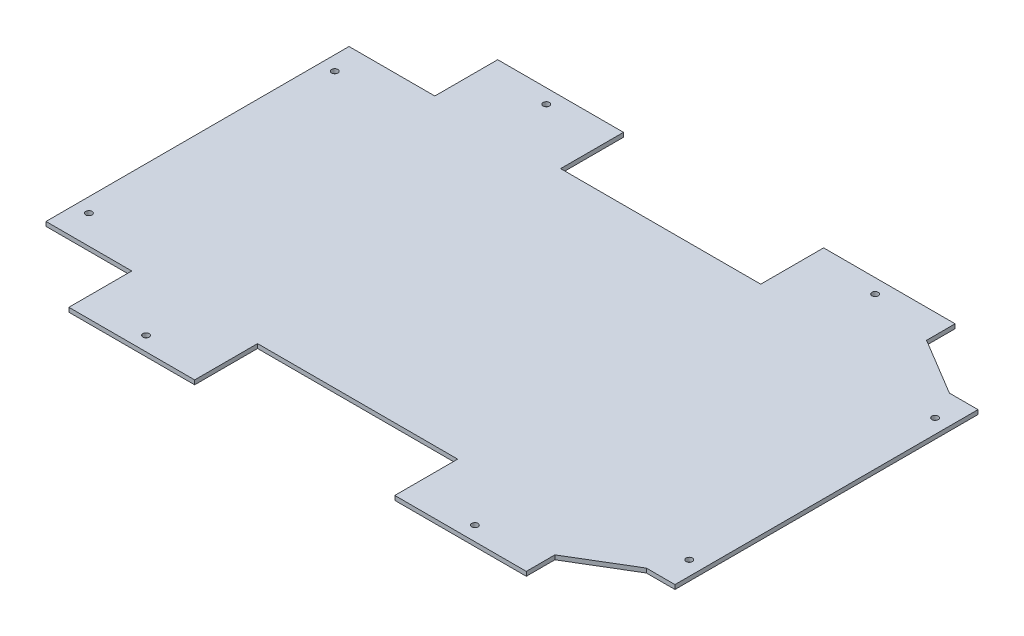
ISO-10303-21;
HEADER;
FILE_DESCRIPTION(('STEP AP214'),'2;1');
FILE_NAME('part.step','',(''),(''),'','','');
FILE_SCHEMA(('AUTOMOTIVE_DESIGN { 1 0 10303 214 1 1 1 1 }'));
ENDSEC;
DATA;
#1=APPLICATION_CONTEXT('core data for automotive mechanical design processes');
#2=APPLICATION_PROTOCOL_DEFINITION('international standard','automotive_design',2000,#1);
#3=PRODUCT_CONTEXT('',#1,'mechanical');
#4=PRODUCT('Part','Part','',(#3));
#5=PRODUCT_RELATED_PRODUCT_CATEGORY('part','',(#4));
#6=PRODUCT_DEFINITION_FORMATION('','',#4);
#7=PRODUCT_DEFINITION_CONTEXT('part definition',#1,'design');
#8=PRODUCT_DEFINITION('design','',#6,#7);
#9=PRODUCT_DEFINITION_SHAPE('','',#8);
#10=(LENGTH_UNIT() NAMED_UNIT(*) SI_UNIT(.MILLI.,.METRE.));
#11=(NAMED_UNIT(*) PLANE_ANGLE_UNIT() SI_UNIT($,.RADIAN.));
#12=(NAMED_UNIT(*) SI_UNIT($,.STERADIAN.) SOLID_ANGLE_UNIT());
#13=UNCERTAINTY_MEASURE_WITH_UNIT(LENGTH_MEASURE(1.E-05),#10,'distance_accuracy_value','');
#14=(GEOMETRIC_REPRESENTATION_CONTEXT(3) GLOBAL_UNCERTAINTY_ASSIGNED_CONTEXT((#13)) GLOBAL_UNIT_ASSIGNED_CONTEXT((#10,
#11,#12)) REPRESENTATION_CONTEXT('',''));
#15=CARTESIAN_POINT('',(0.,0.,0.));
#16=DIRECTION('',(0.,0.,1.));
#17=DIRECTION('',(1.,0.,0.));
#18=AXIS2_PLACEMENT_3D('',#15,#16,#17);
#19=CARTESIAN_POINT('',(217.809683940575,3.,-105.73789445247));
#20=DIRECTION('',(0.,0.,1.));
#21=DIRECTION('',(1.,0.,0.));
#22=AXIS2_PLACEMENT_3D('',#19,#20,#21);
#23=PLANE('',#22);
#24=DIRECTION('',(-1.,0.,0.));
#25=VECTOR('',#24,1.);
#26=CARTESIAN_POINT('',(217.809683940575,0.,-105.73789445247));
#27=LINE('',#26,#25);
#28=CARTESIAN_POINT('',(217.809683940575,0.,-105.73789445247));
#29=VERTEX_POINT('',#28);
#30=CARTESIAN_POINT('',(197.809683940615,0.,-105.73789445247));
#31=VERTEX_POINT('',#30);
#32=EDGE_CURVE('E214',#29,#31,#27,.T.);
#33=ORIENTED_EDGE('',*,*,#32,.T.);
#34=DIRECTION('',(0.,-1.,0.));
#35=VECTOR('',#34,1.);
#36=CARTESIAN_POINT('',(197.809683940615,3.,-105.73789445247));
#37=LINE('',#36,#35);
#38=CARTESIAN_POINT('',(197.809683940615,3.,-105.73789445247));
#39=VERTEX_POINT('',#38);
#40=EDGE_CURVE('E11',#39,#31,#37,.T.);
#41=ORIENTED_EDGE('',*,*,#40,.F.);
#42=DIRECTION('',(-1.,0.,0.));
#43=VECTOR('',#42,1.);
#44=CARTESIAN_POINT('',(217.809683940575,3.,-105.73789445247));
#45=LINE('',#44,#43);
#46=CARTESIAN_POINT('',(217.809683940575,3.,-105.73789445247));
#47=VERTEX_POINT('',#46);
#48=EDGE_CURVE('E257',#47,#39,#45,.T.);
#49=ORIENTED_EDGE('',*,*,#48,.F.);
#50=DIRECTION('',(0.,-1.,0.));
#51=VECTOR('',#50,1.);
#52=CARTESIAN_POINT('',(217.809683940575,3.,-105.73789445247));
#53=LINE('',#52,#51);
#54=EDGE_CURVE('E210',#47,#29,#53,.T.);
#55=ORIENTED_EDGE('',*,*,#54,.T.);
#56=EDGE_LOOP('',(#33,#41,#49,#55));
#57=FACE_BOUND('',#56,.T.);
#58=ADVANCED_FACE('F34',(#57),#23,.F.);
#59=CARTESIAN_POINT('',(197.809683940615,3.,-105.73789445247));
#60=DIRECTION('',(-0.514495755423212,0.,0.857492925715133));
#61=DIRECTION('',(0.857492925715133,0.,0.514495755423212));
#62=AXIS2_PLACEMENT_3D('',#59,#60,#61);
#63=PLANE('',#62);
#64=DIRECTION('',(-0.857492925715133,0.,-0.514495755423212));
#65=VECTOR('',#64,1.);
#66=CARTESIAN_POINT('',(197.809683940615,0.,-105.73789445247));
#67=LINE('',#66,#65);
#68=CARTESIAN_POINT('',(157.809683940159,0.,-129.73789445247));
#69=VERTEX_POINT('',#68);
#70=EDGE_CURVE('E217',#31,#69,#67,.T.);
#71=ORIENTED_EDGE('',*,*,#70,.T.);
#72=DIRECTION('',(0.,-1.,0.));
#73=VECTOR('',#72,1.);
#74=CARTESIAN_POINT('',(157.809683940159,3.,-129.73789445247));
#75=LINE('',#74,#73);
#76=CARTESIAN_POINT('',(157.809683940159,3.,-129.73789445247));
#77=VERTEX_POINT('',#76);
#78=EDGE_CURVE('E42',#77,#69,#75,.T.);
#79=ORIENTED_EDGE('',*,*,#78,.F.);
#80=DIRECTION('',(-0.857492925715133,0.,-0.514495755423212));
#81=VECTOR('',#80,1.);
#82=CARTESIAN_POINT('',(197.809683940615,3.,-105.73789445247));
#83=LINE('',#82,#81);
#84=EDGE_CURVE('E135',#39,#77,#83,.T.);
#85=ORIENTED_EDGE('',*,*,#84,.F.);
#86=ORIENTED_EDGE('',*,*,#40,.T.);
#87=EDGE_LOOP('',(#71,#79,#85,#86));
#88=FACE_BOUND('',#87,.T.);
#89=ADVANCED_FACE('F386',(#88),#63,.F.);
#90=CARTESIAN_POINT('',(157.809683940159,3.,-129.73789445247));
#91=DIRECTION('',(-1.,0.,0.));
#92=DIRECTION('',(0.,0.,1.));
#93=AXIS2_PLACEMENT_3D('',#90,#91,#92);
#94=PLANE('',#93);
#95=DIRECTION('',(0.,0.,-1.));
#96=VECTOR('',#95,1.);
#97=CARTESIAN_POINT('',(157.809683940159,0.,-129.73789445247));
#98=LINE('',#97,#96);
#99=CARTESIAN_POINT('',(157.809683940159,0.,-149.737894452469));
#100=VERTEX_POINT('',#99);
#101=EDGE_CURVE('E220',#69,#100,#98,.T.);
#102=ORIENTED_EDGE('',*,*,#101,.T.);
#103=DIRECTION('',(0.,-1.,0.));
#104=VECTOR('',#103,1.);
#105=CARTESIAN_POINT('',(157.809683940159,3.,-149.737894452469));
#106=LINE('',#105,#104);
#107=CARTESIAN_POINT('',(157.809683940159,3.,-149.737894452469));
#108=VERTEX_POINT('',#107);
#109=EDGE_CURVE('E306',#108,#100,#106,.T.);
#110=ORIENTED_EDGE('',*,*,#109,.F.);
#111=DIRECTION('',(0.,0.,-1.));
#112=VECTOR('',#111,1.);
#113=CARTESIAN_POINT('',(157.809683940159,3.,-129.73789445247));
#114=LINE('',#113,#112);
#115=EDGE_CURVE('E314',#77,#108,#114,.T.);
#116=ORIENTED_EDGE('',*,*,#115,.F.);
#117=ORIENTED_EDGE('',*,*,#78,.T.);
#118=EDGE_LOOP('',(#102,#110,#116,#117));
#119=FACE_BOUND('',#118,.T.);
#120=ADVANCED_FACE('F312',(#119),#94,.F.);
#121=CARTESIAN_POINT('',(157.809683940159,3.,-149.737894452469));
#122=DIRECTION('',(0.,0.,1.));
#123=DIRECTION('',(1.,0.,0.));
#124=AXIS2_PLACEMENT_3D('',#121,#122,#123);
#125=PLANE('',#124);
#126=DIRECTION('',(-1.,0.,0.));
#127=VECTOR('',#126,1.);
#128=CARTESIAN_POINT('',(157.809683940159,0.,-149.737894452469));
#129=LINE('',#128,#127);
#130=CARTESIAN_POINT('',(65.8096845297192,0.,-149.737894452469));
#131=VERTEX_POINT('',#130);
#132=EDGE_CURVE('E222',#100,#131,#129,.T.);
#133=ORIENTED_EDGE('',*,*,#132,.T.);
#134=DIRECTION('',(0.,-1.,0.));
#135=VECTOR('',#134,1.);
#136=CARTESIAN_POINT('',(65.8096845297192,3.,-149.737894452469));
#137=LINE('',#136,#135);
#138=CARTESIAN_POINT('',(65.8096845297192,3.,-149.737894452469));
#139=VERTEX_POINT('',#138);
#140=EDGE_CURVE('E303',#139,#131,#137,.T.);
#141=ORIENTED_EDGE('',*,*,#140,.F.);
#142=DIRECTION('',(-1.,0.,0.));
#143=VECTOR('',#142,1.);
#144=CARTESIAN_POINT('',(157.809683940159,3.,-149.737894452469));
#145=LINE('',#144,#143);
#146=EDGE_CURVE('E332',#108,#139,#145,.T.);
#147=ORIENTED_EDGE('',*,*,#146,.F.);
#148=ORIENTED_EDGE('',*,*,#109,.T.);
#149=EDGE_LOOP('',(#133,#141,#147,#148));
#150=FACE_BOUND('',#149,.T.);
#151=ADVANCED_FACE('F323',(#150),#125,.F.);
#152=CARTESIAN_POINT('',(65.8096845297192,3.,-105.737894452469));
#153=DIRECTION('',(1.,0.,0.));
#154=DIRECTION('',(0.,0.,-1.));
#155=AXIS2_PLACEMENT_3D('',#152,#153,#154);
#156=PLANE('',#155);
#157=DIRECTION('',(0.,0.,1.));
#158=VECTOR('',#157,1.);
#159=CARTESIAN_POINT('',(65.8096845297192,0.,-105.737894452469));
#160=LINE('',#159,#158);
#161=CARTESIAN_POINT('',(65.8096845297192,0.,-105.737894452469));
#162=VERTEX_POINT('',#161);
#163=EDGE_CURVE('E224',#131,#162,#160,.T.);
#164=ORIENTED_EDGE('',*,*,#163,.T.);
#165=DIRECTION('',(0.,-1.,0.));
#166=VECTOR('',#165,1.);
#167=CARTESIAN_POINT('',(65.8096845297192,3.,-105.737894452469));
#168=LINE('',#167,#166);
#169=CARTESIAN_POINT('',(65.8096845297192,3.,-105.737894452469));
#170=VERTEX_POINT('',#169);
#171=EDGE_CURVE('E300',#170,#162,#168,.T.);
#172=ORIENTED_EDGE('',*,*,#171,.F.);
#173=DIRECTION('',(0.,0.,1.));
#174=VECTOR('',#173,1.);
#175=CARTESIAN_POINT('',(65.8096845297192,3.,-105.737894452469));
#176=LINE('',#175,#174);
#177=EDGE_CURVE('E329',#139,#170,#176,.T.);
#178=ORIENTED_EDGE('',*,*,#177,.F.);
#179=ORIENTED_EDGE('',*,*,#140,.T.);
#180=EDGE_LOOP('',(#164,#172,#178,#179));
#181=FACE_BOUND('',#180,.T.);
#182=ADVANCED_FACE('F327',(#181),#156,.F.);
#183=CARTESIAN_POINT('',(65.8096845297192,3.,-105.737894452469));
#184=DIRECTION('',(0.,0.,1.));
#185=DIRECTION('',(1.,0.,0.));
#186=AXIS2_PLACEMENT_3D('',#183,#184,#185);
#187=PLANE('',#186);
#188=DIRECTION('',(-1.,0.,0.));
#189=VECTOR('',#188,1.);
#190=CARTESIAN_POINT('',(65.8096845297192,0.,-105.737894452469));
#191=LINE('',#190,#189);
#192=CARTESIAN_POINT('',(-74.1903154702808,0.,-105.737894452469));
#193=VERTEX_POINT('',#192);
#194=EDGE_CURVE('E226',#162,#193,#191,.T.);
#195=ORIENTED_EDGE('',*,*,#194,.T.);
#196=DIRECTION('',(0.,-1.,0.));
#197=VECTOR('',#196,1.);
#198=CARTESIAN_POINT('',(-74.1903154702808,3.,-105.737894452469));
#199=LINE('',#198,#197);
#200=CARTESIAN_POINT('',(-74.1903154702808,3.,-105.737894452469));
#201=VERTEX_POINT('',#200);
#202=EDGE_CURVE('E297',#201,#193,#199,.T.);
#203=ORIENTED_EDGE('',*,*,#202,.F.);
#204=DIRECTION('',(-1.,0.,0.));
#205=VECTOR('',#204,1.);
#206=CARTESIAN_POINT('',(65.8096845297192,3.,-105.737894452469));
#207=LINE('',#206,#205);
#208=EDGE_CURVE('E331',#170,#201,#207,.T.);
#209=ORIENTED_EDGE('',*,*,#208,.F.);
#210=ORIENTED_EDGE('',*,*,#171,.T.);
#211=EDGE_LOOP('',(#195,#203,#209,#210));
#212=FACE_BOUND('',#211,.T.);
#213=ADVANCED_FACE('F399',(#212),#187,.F.);
#214=CARTESIAN_POINT('',(-74.1903154702808,3.,-105.737894452469));
#215=DIRECTION('',(-1.,0.,0.));
#216=DIRECTION('',(0.,0.,1.));
#217=AXIS2_PLACEMENT_3D('',#214,#215,#216);
#218=PLANE('',#217);
#219=DIRECTION('',(0.,0.,-1.));
#220=VECTOR('',#219,1.);
#221=CARTESIAN_POINT('',(-74.1903154702808,0.,-105.737894452469));
#222=LINE('',#221,#220);
#223=CARTESIAN_POINT('',(-74.1903154702808,0.,-149.737894452469));
#224=VERTEX_POINT('',#223);
#225=EDGE_CURVE('E228',#193,#224,#222,.T.);
#226=ORIENTED_EDGE('',*,*,#225,.T.);
#227=DIRECTION('',(0.,-1.,0.));
#228=VECTOR('',#227,1.);
#229=CARTESIAN_POINT('',(-74.1903154702808,3.,-149.737894452469));
#230=LINE('',#229,#228);
#231=CARTESIAN_POINT('',(-74.1903154702808,3.,-149.737894452469));
#232=VERTEX_POINT('',#231);
#233=EDGE_CURVE('E294',#232,#224,#230,.T.);
#234=ORIENTED_EDGE('',*,*,#233,.F.);
#235=DIRECTION('',(0.,0.,-1.));
#236=VECTOR('',#235,1.);
#237=CARTESIAN_POINT('',(-74.1903154702808,3.,-105.737894452469));
#238=LINE('',#237,#236);
#239=EDGE_CURVE('E334',#201,#232,#238,.T.);
#240=ORIENTED_EDGE('',*,*,#239,.F.);
#241=ORIENTED_EDGE('',*,*,#202,.T.);
#242=EDGE_LOOP('',(#226,#234,#240,#241));
#243=FACE_BOUND('',#242,.T.);
#244=ADVANCED_FACE('F402',(#243),#218,.F.);
#245=CARTESIAN_POINT('',(-74.1903154702808,3.,-149.737894452469));
#246=DIRECTION('',(0.,0.,1.));
#247=DIRECTION('',(1.,0.,0.));
#248=AXIS2_PLACEMENT_3D('',#245,#246,#247);
#249=PLANE('',#248);
#250=DIRECTION('',(-1.,0.,0.));
#251=VECTOR('',#250,1.);
#252=CARTESIAN_POINT('',(-74.1903154702808,0.,-149.737894452469));
#253=LINE('',#252,#251);
#254=CARTESIAN_POINT('',(-162.190315499721,0.,-149.737894452469));
#255=VERTEX_POINT('',#254);
#256=EDGE_CURVE('E230',#224,#255,#253,.T.);
#257=ORIENTED_EDGE('',*,*,#256,.T.);
#258=DIRECTION('',(0.,-1.,0.));
#259=VECTOR('',#258,1.);
#260=CARTESIAN_POINT('',(-162.190315499721,3.,-149.737894452469));
#261=LINE('',#260,#259);
#262=CARTESIAN_POINT('',(-162.190315499721,3.,-149.737894452469));
#263=VERTEX_POINT('',#262);
#264=EDGE_CURVE('E291',#263,#255,#261,.T.);
#265=ORIENTED_EDGE('',*,*,#264,.F.);
#266=DIRECTION('',(-1.,0.,0.));
#267=VECTOR('',#266,1.);
#268=CARTESIAN_POINT('',(-74.1903154702808,3.,-149.737894452469));
#269=LINE('',#268,#267);
#270=EDGE_CURVE('E340',#232,#263,#269,.T.);
#271=ORIENTED_EDGE('',*,*,#270,.F.);
#272=ORIENTED_EDGE('',*,*,#233,.T.);
#273=EDGE_LOOP('',(#257,#265,#271,#272));
#274=FACE_BOUND('',#273,.T.);
#275=ADVANCED_FACE('F406',(#274),#249,.F.);
#276=CARTESIAN_POINT('',(-162.190315499721,3.,-105.737894452469));
#277=DIRECTION('',(1.,0.,0.));
#278=DIRECTION('',(0.,0.,-1.));
#279=AXIS2_PLACEMENT_3D('',#276,#277,#278);
#280=PLANE('',#279);
#281=DIRECTION('',(0.,0.,1.));
#282=VECTOR('',#281,1.);
#283=CARTESIAN_POINT('',(-162.190315499721,0.,-105.737894452469));
#284=LINE('',#283,#282);
#285=CARTESIAN_POINT('',(-162.190315499721,0.,-105.737894452469));
#286=VERTEX_POINT('',#285);
#287=EDGE_CURVE('E232',#255,#286,#284,.T.);
#288=ORIENTED_EDGE('',*,*,#287,.T.);
#289=DIRECTION('',(0.,-1.,0.));
#290=VECTOR('',#289,1.);
#291=CARTESIAN_POINT('',(-162.190315499721,3.,-105.737894452469));
#292=LINE('',#291,#290);
#293=CARTESIAN_POINT('',(-162.190315499721,3.,-105.737894452469));
#294=VERTEX_POINT('',#293);
#295=EDGE_CURVE('E288',#294,#286,#292,.T.);
#296=ORIENTED_EDGE('',*,*,#295,.F.);
#297=DIRECTION('',(0.,0.,1.));
#298=VECTOR('',#297,1.);
#299=CARTESIAN_POINT('',(-162.190315499721,3.,-105.737894452469));
#300=LINE('',#299,#298);
#301=EDGE_CURVE('E342',#263,#294,#300,.T.);
#302=ORIENTED_EDGE('',*,*,#301,.F.);
#303=ORIENTED_EDGE('',*,*,#264,.T.);
#304=EDGE_LOOP('',(#288,#296,#302,#303));
#305=FACE_BOUND('',#304,.T.);
#306=ADVANCED_FACE('F410',(#305),#280,.F.);
#307=CARTESIAN_POINT('',(-162.190315499721,3.,-105.737894452469));
#308=DIRECTION('',(0.,0.,1.));
#309=DIRECTION('',(1.,0.,0.));
#310=AXIS2_PLACEMENT_3D('',#307,#308,#309);
#311=PLANE('',#310);
#312=DIRECTION('',(-1.,0.,0.));
#313=VECTOR('',#312,1.);
#314=CARTESIAN_POINT('',(-162.190315499721,0.,-105.737894452469));
#315=LINE('',#314,#313);
#316=CARTESIAN_POINT('',(-222.190315500245,0.,-105.737894452469));
#317=VERTEX_POINT('',#316);
#318=EDGE_CURVE('E234',#286,#317,#315,.T.);
#319=ORIENTED_EDGE('',*,*,#318,.T.);
#320=DIRECTION('',(0.,-1.,0.));
#321=VECTOR('',#320,1.);
#322=CARTESIAN_POINT('',(-222.190315500245,3.,-105.737894452469));
#323=LINE('',#322,#321);
#324=CARTESIAN_POINT('',(-222.190315500245,3.,-105.737894452469));
#325=VERTEX_POINT('',#324);
#326=EDGE_CURVE('E285',#325,#317,#323,.T.);
#327=ORIENTED_EDGE('',*,*,#326,.F.);
#328=DIRECTION('',(-1.,0.,0.));
#329=VECTOR('',#328,1.);
#330=CARTESIAN_POINT('',(-162.190315499721,3.,-105.737894452469));
#331=LINE('',#330,#329);
#332=EDGE_CURVE('E344',#294,#325,#331,.T.);
#333=ORIENTED_EDGE('',*,*,#332,.F.);
#334=ORIENTED_EDGE('',*,*,#295,.T.);
#335=EDGE_LOOP('',(#319,#327,#333,#334));
#336=FACE_BOUND('',#335,.T.);
#337=ADVANCED_FACE('F414',(#336),#311,.F.);
#338=CARTESIAN_POINT('',(-222.190315500245,3.,-105.737894452469));
#339=DIRECTION('',(1.,0.,0.));
#340=DIRECTION('',(0.,0.,-1.));
#341=AXIS2_PLACEMENT_3D('',#338,#339,#340);
#342=PLANE('',#341);
#343=DIRECTION('',(0.,0.,1.));
#344=VECTOR('',#343,1.);
#345=CARTESIAN_POINT('',(-222.190315500245,0.,-105.737894452469));
#346=LINE('',#345,#344);
#347=CARTESIAN_POINT('',(-222.190315500245,0.,106.262104988581));
#348=VERTEX_POINT('',#347);
#349=EDGE_CURVE('E236',#317,#348,#346,.T.);
#350=ORIENTED_EDGE('',*,*,#349,.T.);
#351=DIRECTION('',(0.,-1.,0.));
#352=VECTOR('',#351,1.);
#353=CARTESIAN_POINT('',(-222.190315500245,3.,106.262104988581));
#354=LINE('',#353,#352);
#355=CARTESIAN_POINT('',(-222.190315500245,3.,106.262104988581));
#356=VERTEX_POINT('',#355);
#357=EDGE_CURVE('E282',#356,#348,#354,.T.);
#358=ORIENTED_EDGE('',*,*,#357,.F.);
#359=DIRECTION('',(0.,0.,1.));
#360=VECTOR('',#359,1.);
#361=CARTESIAN_POINT('',(-222.190315500245,3.,-105.737894452469));
#362=LINE('',#361,#360);
#363=EDGE_CURVE('E346',#325,#356,#362,.T.);
#364=ORIENTED_EDGE('',*,*,#363,.F.);
#365=ORIENTED_EDGE('',*,*,#326,.T.);
#366=EDGE_LOOP('',(#350,#358,#364,#365));
#367=FACE_BOUND('',#366,.T.);
#368=ADVANCED_FACE('F418',(#367),#342,.F.);
#369=CARTESIAN_POINT('',(-222.190315500245,3.,106.262104988581));
#370=DIRECTION('',(0.,0.,-1.));
#371=DIRECTION('',(-1.,0.,0.));
#372=AXIS2_PLACEMENT_3D('',#369,#370,#371);
#373=PLANE('',#372);
#374=DIRECTION('',(1.,0.,0.));
#375=VECTOR('',#374,1.);
#376=CARTESIAN_POINT('',(-222.190315500245,0.,106.262104988581));
#377=LINE('',#376,#375);
#378=CARTESIAN_POINT('',(-162.190315499721,0.,106.262104988581));
#379=VERTEX_POINT('',#378);
#380=EDGE_CURVE('E238',#348,#379,#377,.T.);
#381=ORIENTED_EDGE('',*,*,#380,.T.);
#382=DIRECTION('',(0.,-1.,0.));
#383=VECTOR('',#382,1.);
#384=CARTESIAN_POINT('',(-162.190315499721,3.,106.262104988581));
#385=LINE('',#384,#383);
#386=CARTESIAN_POINT('',(-162.190315499721,3.,106.262104988581));
#387=VERTEX_POINT('',#386);
#388=EDGE_CURVE('E279',#387,#379,#385,.T.);
#389=ORIENTED_EDGE('',*,*,#388,.F.);
#390=DIRECTION('',(1.,0.,0.));
#391=VECTOR('',#390,1.);
#392=CARTESIAN_POINT('',(-222.190315500245,3.,106.262104988581));
#393=LINE('',#392,#391);
#394=EDGE_CURVE('E348',#356,#387,#393,.T.);
#395=ORIENTED_EDGE('',*,*,#394,.F.);
#396=ORIENTED_EDGE('',*,*,#357,.T.);
#397=EDGE_LOOP('',(#381,#389,#395,#396));
#398=FACE_BOUND('',#397,.T.);
#399=ADVANCED_FACE('F422',(#398),#373,.F.);
#400=CARTESIAN_POINT('',(-162.190315499721,3.,106.262104988581));
#401=DIRECTION('',(1.,0.,0.));
#402=DIRECTION('',(0.,0.,-1.));
#403=AXIS2_PLACEMENT_3D('',#400,#401,#402);
#404=PLANE('',#403);
#405=DIRECTION('',(0.,0.,1.));
#406=VECTOR('',#405,1.);
#407=CARTESIAN_POINT('',(-162.190315499721,0.,106.262104988581));
#408=LINE('',#407,#406);
#409=CARTESIAN_POINT('',(-162.190315499721,0.,150.262104988581));
#410=VERTEX_POINT('',#409);
#411=EDGE_CURVE('E240',#379,#410,#408,.T.);
#412=ORIENTED_EDGE('',*,*,#411,.T.);
#413=DIRECTION('',(0.,-1.,0.));
#414=VECTOR('',#413,1.);
#415=CARTESIAN_POINT('',(-162.190315499721,3.,150.262104988581));
#416=LINE('',#415,#414);
#417=CARTESIAN_POINT('',(-162.190315499721,3.,150.262104988581));
#418=VERTEX_POINT('',#417);
#419=EDGE_CURVE('E276',#418,#410,#416,.T.);
#420=ORIENTED_EDGE('',*,*,#419,.F.);
#421=DIRECTION('',(0.,0.,1.));
#422=VECTOR('',#421,1.);
#423=CARTESIAN_POINT('',(-162.190315499721,3.,106.262104988581));
#424=LINE('',#423,#422);
#425=EDGE_CURVE('E350',#387,#418,#424,.T.);
#426=ORIENTED_EDGE('',*,*,#425,.F.);
#427=ORIENTED_EDGE('',*,*,#388,.T.);
#428=EDGE_LOOP('',(#412,#420,#426,#427));
#429=FACE_BOUND('',#428,.T.);
#430=ADVANCED_FACE('F426',(#429),#404,.F.);
#431=CARTESIAN_POINT('',(-162.190315499721,3.,150.262104988581));
#432=DIRECTION('',(0.,0.,-1.));
#433=DIRECTION('',(-1.,0.,0.));
#434=AXIS2_PLACEMENT_3D('',#431,#432,#433);
#435=PLANE('',#434);
#436=DIRECTION('',(1.,0.,0.));
#437=VECTOR('',#436,1.);
#438=CARTESIAN_POINT('',(-162.190315499721,0.,150.262104988581));
#439=LINE('',#438,#437);
#440=CARTESIAN_POINT('',(-74.1903154702808,0.,150.262104988581));
#441=VERTEX_POINT('',#440);
#442=EDGE_CURVE('E242',#410,#441,#439,.T.);
#443=ORIENTED_EDGE('',*,*,#442,.T.);
#444=DIRECTION('',(0.,-1.,0.));
#445=VECTOR('',#444,1.);
#446=CARTESIAN_POINT('',(-74.1903154702808,3.,150.262104988581));
#447=LINE('',#446,#445);
#448=CARTESIAN_POINT('',(-74.1903154702808,3.,150.262104988581));
#449=VERTEX_POINT('',#448);
#450=EDGE_CURVE('E273',#449,#441,#447,.T.);
#451=ORIENTED_EDGE('',*,*,#450,.F.);
#452=DIRECTION('',(1.,0.,0.));
#453=VECTOR('',#452,1.);
#454=CARTESIAN_POINT('',(-162.190315499721,3.,150.262104988581));
#455=LINE('',#454,#453);
#456=EDGE_CURVE('E352',#418,#449,#455,.T.);
#457=ORIENTED_EDGE('',*,*,#456,.F.);
#458=ORIENTED_EDGE('',*,*,#419,.T.);
#459=EDGE_LOOP('',(#443,#451,#457,#458));
#460=FACE_BOUND('',#459,.T.);
#461=ADVANCED_FACE('F430',(#460),#435,.F.);
#462=CARTESIAN_POINT('',(-74.1903154702808,3.,106.262104988581));
#463=DIRECTION('',(-1.,0.,0.));
#464=DIRECTION('',(0.,0.,1.));
#465=AXIS2_PLACEMENT_3D('',#462,#463,#464);
#466=PLANE('',#465);
#467=DIRECTION('',(0.,0.,-1.));
#468=VECTOR('',#467,1.);
#469=CARTESIAN_POINT('',(-74.1903154702808,0.,106.262104988581));
#470=LINE('',#469,#468);
#471=CARTESIAN_POINT('',(-74.1903154702808,0.,106.262104988581));
#472=VERTEX_POINT('',#471);
#473=EDGE_CURVE('E244',#441,#472,#470,.T.);
#474=ORIENTED_EDGE('',*,*,#473,.T.);
#475=DIRECTION('',(0.,-1.,0.));
#476=VECTOR('',#475,1.);
#477=CARTESIAN_POINT('',(-74.1903154702808,3.,106.262104988581));
#478=LINE('',#477,#476);
#479=CARTESIAN_POINT('',(-74.1903154702808,3.,106.262104988581));
#480=VERTEX_POINT('',#479);
#481=EDGE_CURVE('E270',#480,#472,#478,.T.);
#482=ORIENTED_EDGE('',*,*,#481,.F.);
#483=DIRECTION('',(0.,0.,-1.));
#484=VECTOR('',#483,1.);
#485=CARTESIAN_POINT('',(-74.1903154702808,3.,106.262104988581));
#486=LINE('',#485,#484);
#487=EDGE_CURVE('E354',#449,#480,#486,.T.);
#488=ORIENTED_EDGE('',*,*,#487,.F.);
#489=ORIENTED_EDGE('',*,*,#450,.T.);
#490=EDGE_LOOP('',(#474,#482,#488,#489));
#491=FACE_BOUND('',#490,.T.);
#492=ADVANCED_FACE('F434',(#491),#466,.F.);
#493=CARTESIAN_POINT('',(-74.1903154702808,3.,106.262104988581));
#494=DIRECTION('',(0.,0.,-1.));
#495=DIRECTION('',(-1.,0.,0.));
#496=AXIS2_PLACEMENT_3D('',#493,#494,#495);
#497=PLANE('',#496);
#498=DIRECTION('',(1.,0.,0.));
#499=VECTOR('',#498,1.);
#500=CARTESIAN_POINT('',(-74.1903154702808,0.,106.262104988581));
#501=LINE('',#500,#499);
#502=CARTESIAN_POINT('',(65.8096845297192,0.,106.262104988581));
#503=VERTEX_POINT('',#502);
#504=EDGE_CURVE('E246',#472,#503,#501,.T.);
#505=ORIENTED_EDGE('',*,*,#504,.T.);
#506=DIRECTION('',(0.,-1.,0.));
#507=VECTOR('',#506,1.);
#508=CARTESIAN_POINT('',(65.8096845297192,3.,106.262104988581));
#509=LINE('',#508,#507);
#510=CARTESIAN_POINT('',(65.8096845297192,3.,106.262104988581));
#511=VERTEX_POINT('',#510);
#512=EDGE_CURVE('E267',#511,#503,#509,.T.);
#513=ORIENTED_EDGE('',*,*,#512,.F.);
#514=DIRECTION('',(1.,0.,0.));
#515=VECTOR('',#514,1.);
#516=CARTESIAN_POINT('',(-74.1903154702808,3.,106.262104988581));
#517=LINE('',#516,#515);
#518=EDGE_CURVE('E356',#480,#511,#517,.T.);
#519=ORIENTED_EDGE('',*,*,#518,.F.);
#520=ORIENTED_EDGE('',*,*,#481,.T.);
#521=EDGE_LOOP('',(#505,#513,#519,#520));
#522=FACE_BOUND('',#521,.T.);
#523=ADVANCED_FACE('F438',(#522),#497,.F.);
#524=CARTESIAN_POINT('',(65.8096845297192,3.,106.262104988581));
#525=DIRECTION('',(1.,0.,0.));
#526=DIRECTION('',(0.,0.,-1.));
#527=AXIS2_PLACEMENT_3D('',#524,#525,#526);
#528=PLANE('',#527);
#529=DIRECTION('',(0.,0.,1.));
#530=VECTOR('',#529,1.);
#531=CARTESIAN_POINT('',(65.8096845297192,0.,106.262104988581));
#532=LINE('',#531,#530);
#533=CARTESIAN_POINT('',(65.8096845297192,0.,150.262104988581));
#534=VERTEX_POINT('',#533);
#535=EDGE_CURVE('E248',#503,#534,#532,.T.);
#536=ORIENTED_EDGE('',*,*,#535,.T.);
#537=DIRECTION('',(0.,-1.,0.));
#538=VECTOR('',#537,1.);
#539=CARTESIAN_POINT('',(65.8096845297192,3.,150.262104988581));
#540=LINE('',#539,#538);
#541=CARTESIAN_POINT('',(65.8096845297192,3.,150.262104988581));
#542=VERTEX_POINT('',#541);
#543=EDGE_CURVE('E264',#542,#534,#540,.T.);
#544=ORIENTED_EDGE('',*,*,#543,.F.);
#545=DIRECTION('',(0.,0.,1.));
#546=VECTOR('',#545,1.);
#547=CARTESIAN_POINT('',(65.8096845297192,3.,106.262104988581));
#548=LINE('',#547,#546);
#549=EDGE_CURVE('E358',#511,#542,#548,.T.);
#550=ORIENTED_EDGE('',*,*,#549,.F.);
#551=ORIENTED_EDGE('',*,*,#512,.T.);
#552=EDGE_LOOP('',(#536,#544,#550,#551));
#553=FACE_BOUND('',#552,.T.);
#554=ADVANCED_FACE('F442',(#553),#528,.F.);
#555=CARTESIAN_POINT('',(65.8096845297192,3.,150.262104988581));
#556=DIRECTION('',(0.,0.,-1.));
#557=DIRECTION('',(-1.,0.,0.));
#558=AXIS2_PLACEMENT_3D('',#555,#556,#557);
#559=PLANE('',#558);
#560=DIRECTION('',(1.,0.,0.));
#561=VECTOR('',#560,1.);
#562=CARTESIAN_POINT('',(65.8096845297192,0.,150.262104988581));
#563=LINE('',#562,#561);
#564=CARTESIAN_POINT('',(157.809683940159,0.,150.262104988581));
#565=VERTEX_POINT('',#564);
#566=EDGE_CURVE('E250',#534,#565,#563,.T.);
#567=ORIENTED_EDGE('',*,*,#566,.T.);
#568=DIRECTION('',(0.,-1.,0.));
#569=VECTOR('',#568,1.);
#570=CARTESIAN_POINT('',(157.809683940159,3.,150.262104988581));
#571=LINE('',#570,#569);
#572=CARTESIAN_POINT('',(157.809683940159,3.,150.262104988581));
#573=VERTEX_POINT('',#572);
#574=EDGE_CURVE('E261',#573,#565,#571,.T.);
#575=ORIENTED_EDGE('',*,*,#574,.F.);
#576=DIRECTION('',(1.,0.,0.));
#577=VECTOR('',#576,1.);
#578=CARTESIAN_POINT('',(65.8096845297192,3.,150.262104988581));
#579=LINE('',#578,#577);
#580=EDGE_CURVE('E360',#542,#573,#579,.T.);
#581=ORIENTED_EDGE('',*,*,#580,.F.);
#582=ORIENTED_EDGE('',*,*,#543,.T.);
#583=EDGE_LOOP('',(#567,#575,#581,#582));
#584=FACE_BOUND('',#583,.T.);
#585=ADVANCED_FACE('F366',(#584),#559,.F.);
#586=CARTESIAN_POINT('',(157.809683940159,3.,130.262104988581));
#587=DIRECTION('',(-1.,0.,0.));
#588=DIRECTION('',(0.,0.,1.));
#589=AXIS2_PLACEMENT_3D('',#586,#587,#588);
#590=PLANE('',#589);
#591=DIRECTION('',(0.,0.,-1.));
#592=VECTOR('',#591,1.);
#593=CARTESIAN_POINT('',(157.809683940159,0.,130.262104988581));
#594=LINE('',#593,#592);
#595=CARTESIAN_POINT('',(157.809683940159,0.,130.262104988581));
#596=VERTEX_POINT('',#595);
#597=EDGE_CURVE('E252',#565,#596,#594,.T.);
#598=ORIENTED_EDGE('',*,*,#597,.T.);
#599=DIRECTION('',(0.,-1.,0.));
#600=VECTOR('',#599,1.);
#601=CARTESIAN_POINT('',(157.809683940159,3.,130.262104988581));
#602=LINE('',#601,#600);
#603=CARTESIAN_POINT('',(157.809683940159,3.,130.262104988581));
#604=VERTEX_POINT('',#603);
#605=EDGE_CURVE('E205',#604,#596,#602,.T.);
#606=ORIENTED_EDGE('',*,*,#605,.F.);
#607=DIRECTION('',(0.,0.,-1.));
#608=VECTOR('',#607,1.);
#609=CARTESIAN_POINT('',(157.809683940159,3.,130.262104988581));
#610=LINE('',#609,#608);
#611=EDGE_CURVE('E196',#573,#604,#610,.T.);
#612=ORIENTED_EDGE('',*,*,#611,.F.);
#613=ORIENTED_EDGE('',*,*,#574,.T.);
#614=EDGE_LOOP('',(#598,#606,#612,#613));
#615=FACE_BOUND('',#614,.T.);
#616=ADVANCED_FACE('F370',(#615),#590,.F.);
#617=CARTESIAN_POINT('',(197.809683940615,3.,106.262104988581));
#618=DIRECTION('',(-0.514495755423212,0.,-0.857492925715133));
#619=DIRECTION('',(-0.857492925715133,0.,0.514495755423212));
#620=AXIS2_PLACEMENT_3D('',#617,#618,#619);
#621=PLANE('',#620);
#622=DIRECTION('',(0.857492925715133,0.,-0.514495755423212));
#623=VECTOR('',#622,1.);
#624=CARTESIAN_POINT('',(197.809683940615,0.,106.262104988581));
#625=LINE('',#624,#623);
#626=CARTESIAN_POINT('',(197.809683940615,0.,106.262104988581));
#627=VERTEX_POINT('',#626);
#628=EDGE_CURVE('E204',#596,#627,#625,.T.);
#629=ORIENTED_EDGE('',*,*,#628,.T.);
#630=DIRECTION('',(0.,-1.,0.));
#631=VECTOR('',#630,1.);
#632=CARTESIAN_POINT('',(197.809683940615,3.,106.262104988581));
#633=LINE('',#632,#631);
#634=CARTESIAN_POINT('',(197.809683940615,3.,106.262104988581));
#635=VERTEX_POINT('',#634);
#636=EDGE_CURVE('E201',#635,#627,#633,.T.);
#637=ORIENTED_EDGE('',*,*,#636,.F.);
#638=DIRECTION('',(0.857492925715133,0.,-0.514495755423212));
#639=VECTOR('',#638,1.);
#640=CARTESIAN_POINT('',(197.809683940615,3.,106.262104988581));
#641=LINE('',#640,#639);
#642=EDGE_CURVE('E190',#604,#635,#641,.T.);
#643=ORIENTED_EDGE('',*,*,#642,.F.);
#644=ORIENTED_EDGE('',*,*,#605,.T.);
#645=EDGE_LOOP('',(#629,#637,#643,#644));
#646=FACE_BOUND('',#645,.T.);
#647=ADVANCED_FACE('F202',(#646),#621,.F.);
#648=CARTESIAN_POINT('',(197.809683940615,3.,106.262104988581));
#649=DIRECTION('',(0.,0.,-1.));
#650=DIRECTION('',(-1.,0.,0.));
#651=AXIS2_PLACEMENT_3D('',#648,#649,#650);
#652=PLANE('',#651);
#653=DIRECTION('',(1.,0.,0.));
#654=VECTOR('',#653,1.);
#655=CARTESIAN_POINT('',(197.809683940615,0.,106.262104988581));
#656=LINE('',#655,#654);
#657=CARTESIAN_POINT('',(217.809683940575,0.,106.262104988581));
#658=VERTEX_POINT('',#657);
#659=EDGE_CURVE('E121',#627,#658,#656,.T.);
#660=ORIENTED_EDGE('',*,*,#659,.T.);
#661=DIRECTION('',(0.,-1.,0.));
#662=VECTOR('',#661,1.);
#663=CARTESIAN_POINT('',(217.809683940575,3.,106.262104988581));
#664=LINE('',#663,#662);
#665=CARTESIAN_POINT('',(217.809683940575,3.,106.262104988581));
#666=VERTEX_POINT('',#665);
#667=EDGE_CURVE('E206',#666,#658,#664,.T.);
#668=ORIENTED_EDGE('',*,*,#667,.F.);
#669=DIRECTION('',(1.,0.,0.));
#670=VECTOR('',#669,1.);
#671=CARTESIAN_POINT('',(197.809683940615,3.,106.262104988581));
#672=LINE('',#671,#670);
#673=EDGE_CURVE('E194',#635,#666,#672,.T.);
#674=ORIENTED_EDGE('',*,*,#673,.F.);
#675=ORIENTED_EDGE('',*,*,#636,.T.);
#676=EDGE_LOOP('',(#660,#668,#674,#675));
#677=FACE_BOUND('',#676,.T.);
#678=ADVANCED_FACE('F208',(#677),#652,.F.);
#679=CARTESIAN_POINT('',(217.809683940575,3.,106.262104988581));
#680=DIRECTION('',(-1.,0.,0.));
#681=DIRECTION('',(0.,0.,1.));
#682=AXIS2_PLACEMENT_3D('',#679,#680,#681);
#683=PLANE('',#682);
#684=DIRECTION('',(0.,0.,-1.));
#685=VECTOR('',#684,1.);
#686=CARTESIAN_POINT('',(217.809683940575,0.,106.262104988581));
#687=LINE('',#686,#685);
#688=EDGE_CURVE('E127',#658,#29,#687,.T.);
#689=ORIENTED_EDGE('',*,*,#688,.T.);
#690=ORIENTED_EDGE('',*,*,#54,.F.);
#691=DIRECTION('',(0.,0.,-1.));
#692=VECTOR('',#691,1.);
#693=CARTESIAN_POINT('',(217.809683940575,3.,106.262104988581));
#694=LINE('',#693,#692);
#695=EDGE_CURVE('E50',#666,#47,#694,.T.);
#696=ORIENTED_EDGE('',*,*,#695,.F.);
#697=ORIENTED_EDGE('',*,*,#667,.T.);
#698=EDGE_LOOP('',(#689,#690,#696,#697));
#699=FACE_BOUND('',#698,.T.);
#700=ADVANCED_FACE('F374',(#699),#683,.F.);
#701=CARTESIAN_POINT('',(0.,3.,0.));
#702=DIRECTION('',(0.,-1.,0.));
#703=DIRECTION('',(0.,0.,-1.));
#704=AXIS2_PLACEMENT_3D('',#701,#702,#703);
#705=PLANE('',#704);
#706=CARTESIAN_POINT('',(207.809683940575,3.,-85.7378944524695));
#707=DIRECTION('',(0.,-1.,0.));
#708=DIRECTION('',(0.,0.,-1.));
#709=AXIS2_PLACEMENT_3D('',#706,#707,#708);
#710=CIRCLE('',#709,2.19999999999998);
#711=CARTESIAN_POINT('',(207.809683940575,3.,-87.9378944524695));
#712=VERTEX_POINT('',#711);
#713=EDGE_CURVE('E569',#712,#712,#710,.T.);
#714=ORIENTED_EDGE('',*,*,#713,.T.);
#715=EDGE_LOOP('',(#714));
#716=FACE_BOUND('',#715,.T.);
#717=CARTESIAN_POINT('',(207.809683940575,3.,86.2621049885806));
#718=DIRECTION('',(0.,-1.,0.));
#719=DIRECTION('',(0.,0.,-1.));
#720=AXIS2_PLACEMENT_3D('',#717,#718,#719);
#721=CIRCLE('',#720,2.19999999999998);
#722=CARTESIAN_POINT('',(207.809683940575,3.,84.0621049885806));
#723=VERTEX_POINT('',#722);
#724=EDGE_CURVE('E573',#723,#723,#721,.T.);
#725=ORIENTED_EDGE('',*,*,#724,.T.);
#726=EDGE_LOOP('',(#725));
#727=FACE_BOUND('',#726,.T.);
#728=CARTESIAN_POINT('',(111.809684234939,3.,140.262104988581));
#729=DIRECTION('',(0.,-1.,0.));
#730=DIRECTION('',(0.,0.,-1.));
#731=AXIS2_PLACEMENT_3D('',#728,#729,#730);
#732=CIRCLE('',#731,2.19999999999999);
#733=CARTESIAN_POINT('',(111.809684234939,3.,138.062104988581));
#734=VERTEX_POINT('',#733);
#735=EDGE_CURVE('E582',#734,#734,#732,.T.);
#736=ORIENTED_EDGE('',*,*,#735,.T.);
#737=EDGE_LOOP('',(#736));
#738=FACE_BOUND('',#737,.T.);
#739=CARTESIAN_POINT('',(-118.190315485001,3.,140.26210498858));
#740=DIRECTION('',(0.,-1.,0.));
#741=DIRECTION('',(0.,0.,-1.));
#742=AXIS2_PLACEMENT_3D('',#739,#740,#741);
#743=CIRCLE('',#742,2.19999999999999);
#744=CARTESIAN_POINT('',(-118.190315485001,3.,138.062104988581));
#745=VERTEX_POINT('',#744);
#746=EDGE_CURVE('E588',#745,#745,#743,.T.);
#747=ORIENTED_EDGE('',*,*,#746,.T.);
#748=EDGE_LOOP('',(#747));
#749=FACE_BOUND('',#748,.T.);
#750=CARTESIAN_POINT('',(111.809684234939,3.,-139.737894452469));
#751=DIRECTION('',(0.,-1.,0.));
#752=DIRECTION('',(0.,0.,-1.));
#753=AXIS2_PLACEMENT_3D('',#750,#751,#752);
#754=CIRCLE('',#753,2.19999999999999);
#755=CARTESIAN_POINT('',(111.809684234939,3.,-141.937894452469));
#756=VERTEX_POINT('',#755);
#757=EDGE_CURVE('E594',#756,#756,#754,.T.);
#758=ORIENTED_EDGE('',*,*,#757,.T.);
#759=EDGE_LOOP('',(#758));
#760=FACE_BOUND('',#759,.T.);
#761=CARTESIAN_POINT('',(-118.190315485001,3.,-139.73789445247));
#762=DIRECTION('',(0.,-1.,0.));
#763=DIRECTION('',(0.,0.,-1.));
#764=AXIS2_PLACEMENT_3D('',#761,#762,#763);
#765=CIRCLE('',#764,2.19999999999999);
#766=CARTESIAN_POINT('',(-118.190315485001,3.,-141.93789445247));
#767=VERTEX_POINT('',#766);
#768=EDGE_CURVE('E600',#767,#767,#765,.T.);
#769=ORIENTED_EDGE('',*,*,#768,.T.);
#770=EDGE_LOOP('',(#769));
#771=FACE_BOUND('',#770,.T.);
#772=CARTESIAN_POINT('',(-212.190315500245,3.,-85.7378944524694));
#773=DIRECTION('',(0.,-1.,0.));
#774=DIRECTION('',(0.,0.,-1.));
#775=AXIS2_PLACEMENT_3D('',#772,#773,#774);
#776=CIRCLE('',#775,2.19999999999998);
#777=CARTESIAN_POINT('',(-212.190315500245,3.,-87.9378944524694));
#778=VERTEX_POINT('',#777);
#779=EDGE_CURVE('E606',#778,#778,#776,.T.);
#780=ORIENTED_EDGE('',*,*,#779,.T.);
#781=EDGE_LOOP('',(#780));
#782=FACE_BOUND('',#781,.T.);
#783=CARTESIAN_POINT('',(-212.190315500245,3.,86.2621049885806));
#784=DIRECTION('',(0.,-1.,0.));
#785=DIRECTION('',(0.,0.,-1.));
#786=AXIS2_PLACEMENT_3D('',#783,#784,#785);
#787=CIRCLE('',#786,2.19999999999998);
#788=CARTESIAN_POINT('',(-212.190315500245,3.,84.0621049885806));
#789=VERTEX_POINT('',#788);
#790=EDGE_CURVE('E218',#789,#789,#787,.T.);
#791=ORIENTED_EDGE('',*,*,#790,.T.);
#792=EDGE_LOOP('',(#791));
#793=FACE_BOUND('',#792,.T.);
#794=ORIENTED_EDGE('',*,*,#48,.T.);
#795=ORIENTED_EDGE('',*,*,#84,.T.);
#796=ORIENTED_EDGE('',*,*,#115,.T.);
#797=ORIENTED_EDGE('',*,*,#146,.T.);
#798=ORIENTED_EDGE('',*,*,#177,.T.);
#799=ORIENTED_EDGE('',*,*,#208,.T.);
#800=ORIENTED_EDGE('',*,*,#239,.T.);
#801=ORIENTED_EDGE('',*,*,#270,.T.);
#802=ORIENTED_EDGE('',*,*,#301,.T.);
#803=ORIENTED_EDGE('',*,*,#332,.T.);
#804=ORIENTED_EDGE('',*,*,#363,.T.);
#805=ORIENTED_EDGE('',*,*,#394,.T.);
#806=ORIENTED_EDGE('',*,*,#425,.T.);
#807=ORIENTED_EDGE('',*,*,#456,.T.);
#808=ORIENTED_EDGE('',*,*,#487,.T.);
#809=ORIENTED_EDGE('',*,*,#518,.T.);
#810=ORIENTED_EDGE('',*,*,#549,.T.);
#811=ORIENTED_EDGE('',*,*,#580,.T.);
#812=ORIENTED_EDGE('',*,*,#611,.T.);
#813=ORIENTED_EDGE('',*,*,#642,.T.);
#814=ORIENTED_EDGE('',*,*,#673,.T.);
#815=ORIENTED_EDGE('',*,*,#695,.T.);
#816=EDGE_LOOP('',(#794,#795,#796,#797,#798,#799,#800,#801,#802,#803,#804,#805,#806,#807,#808,
#809,#810,#811,#812,#813,#814,#815));
#817=FACE_BOUND('',#816,.T.);
#818=ADVANCED_FACE('F192',(#716,#727,#738,#749,#760,#771,#782,#793,#817),#705,.F.);
#819=CARTESIAN_POINT('',(0.,0.,0.));
#820=DIRECTION('',(0.,-1.,0.));
#821=DIRECTION('',(0.,0.,-1.));
#822=AXIS2_PLACEMENT_3D('',#819,#820,#821);
#823=PLANE('',#822);
#824=CARTESIAN_POINT('',(207.809683940575,0.,-85.7378944524695));
#825=DIRECTION('',(0.,-1.,0.));
#826=DIRECTION('',(0.,0.,-1.));
#827=AXIS2_PLACEMENT_3D('',#824,#825,#826);
#828=CIRCLE('',#827,2.19999999999998);
#829=CARTESIAN_POINT('',(207.809683940575,0.,-87.9378944524695));
#830=VERTEX_POINT('',#829);
#831=EDGE_CURVE('E566',#830,#830,#828,.T.);
#832=ORIENTED_EDGE('',*,*,#831,.F.);
#833=EDGE_LOOP('',(#832));
#834=FACE_BOUND('',#833,.T.);
#835=CARTESIAN_POINT('',(207.809683940575,0.,86.2621049885806));
#836=DIRECTION('',(0.,-1.,0.));
#837=DIRECTION('',(0.,0.,-1.));
#838=AXIS2_PLACEMENT_3D('',#835,#836,#837);
#839=CIRCLE('',#838,2.19999999999998);
#840=CARTESIAN_POINT('',(207.809683940575,0.,84.0621049885806));
#841=VERTEX_POINT('',#840);
#842=EDGE_CURVE('E570',#841,#841,#839,.T.);
#843=ORIENTED_EDGE('',*,*,#842,.F.);
#844=EDGE_LOOP('',(#843));
#845=FACE_BOUND('',#844,.T.);
#846=CARTESIAN_POINT('',(111.809684234939,0.,140.262104988581));
#847=DIRECTION('',(0.,-1.,0.));
#848=DIRECTION('',(0.,0.,-1.));
#849=AXIS2_PLACEMENT_3D('',#846,#847,#848);
#850=CIRCLE('',#849,2.19999999999999);
#851=CARTESIAN_POINT('',(111.809684234939,0.,138.062104988581));
#852=VERTEX_POINT('',#851);
#853=EDGE_CURVE('E579',#852,#852,#850,.T.);
#854=ORIENTED_EDGE('',*,*,#853,.F.);
#855=EDGE_LOOP('',(#854));
#856=FACE_BOUND('',#855,.T.);
#857=CARTESIAN_POINT('',(-118.190315485001,0.,140.26210498858));
#858=DIRECTION('',(0.,-1.,0.));
#859=DIRECTION('',(0.,0.,-1.));
#860=AXIS2_PLACEMENT_3D('',#857,#858,#859);
#861=CIRCLE('',#860,2.19999999999999);
#862=CARTESIAN_POINT('',(-118.190315485001,0.,138.062104988581));
#863=VERTEX_POINT('',#862);
#864=EDGE_CURVE('E585',#863,#863,#861,.T.);
#865=ORIENTED_EDGE('',*,*,#864,.F.);
#866=EDGE_LOOP('',(#865));
#867=FACE_BOUND('',#866,.T.);
#868=CARTESIAN_POINT('',(111.809684234939,0.,-139.737894452469));
#869=DIRECTION('',(0.,-1.,0.));
#870=DIRECTION('',(0.,0.,-1.));
#871=AXIS2_PLACEMENT_3D('',#868,#869,#870);
#872=CIRCLE('',#871,2.19999999999999);
#873=CARTESIAN_POINT('',(111.809684234939,0.,-141.937894452469));
#874=VERTEX_POINT('',#873);
#875=EDGE_CURVE('E591',#874,#874,#872,.T.);
#876=ORIENTED_EDGE('',*,*,#875,.F.);
#877=EDGE_LOOP('',(#876));
#878=FACE_BOUND('',#877,.T.);
#879=CARTESIAN_POINT('',(-118.190315485001,0.,-139.73789445247));
#880=DIRECTION('',(0.,-1.,0.));
#881=DIRECTION('',(0.,0.,-1.));
#882=AXIS2_PLACEMENT_3D('',#879,#880,#881);
#883=CIRCLE('',#882,2.19999999999999);
#884=CARTESIAN_POINT('',(-118.190315485001,0.,-141.93789445247));
#885=VERTEX_POINT('',#884);
#886=EDGE_CURVE('E597',#885,#885,#883,.T.);
#887=ORIENTED_EDGE('',*,*,#886,.F.);
#888=EDGE_LOOP('',(#887));
#889=FACE_BOUND('',#888,.T.);
#890=CARTESIAN_POINT('',(-212.190315500245,0.,-85.7378944524694));
#891=DIRECTION('',(0.,-1.,0.));
#892=DIRECTION('',(0.,0.,-1.));
#893=AXIS2_PLACEMENT_3D('',#890,#891,#892);
#894=CIRCLE('',#893,2.19999999999998);
#895=CARTESIAN_POINT('',(-212.190315500245,0.,-87.9378944524694));
#896=VERTEX_POINT('',#895);
#897=EDGE_CURVE('E603',#896,#896,#894,.T.);
#898=ORIENTED_EDGE('',*,*,#897,.F.);
#899=EDGE_LOOP('',(#898));
#900=FACE_BOUND('',#899,.T.);
#901=CARTESIAN_POINT('',(-212.190315500245,0.,86.2621049885806));
#902=DIRECTION('',(0.,-1.,0.));
#903=DIRECTION('',(0.,0.,-1.));
#904=AXIS2_PLACEMENT_3D('',#901,#902,#903);
#905=CIRCLE('',#904,2.19999999999998);
#906=CARTESIAN_POINT('',(-212.190315500245,0.,84.0621049885806));
#907=VERTEX_POINT('',#906);
#908=EDGE_CURVE('E609',#907,#907,#905,.T.);
#909=ORIENTED_EDGE('',*,*,#908,.F.);
#910=EDGE_LOOP('',(#909));
#911=FACE_BOUND('',#910,.T.);
#912=ORIENTED_EDGE('',*,*,#32,.F.);
#913=ORIENTED_EDGE('',*,*,#688,.F.);
#914=ORIENTED_EDGE('',*,*,#659,.F.);
#915=ORIENTED_EDGE('',*,*,#628,.F.);
#916=ORIENTED_EDGE('',*,*,#597,.F.);
#917=ORIENTED_EDGE('',*,*,#566,.F.);
#918=ORIENTED_EDGE('',*,*,#535,.F.);
#919=ORIENTED_EDGE('',*,*,#504,.F.);
#920=ORIENTED_EDGE('',*,*,#473,.F.);
#921=ORIENTED_EDGE('',*,*,#442,.F.);
#922=ORIENTED_EDGE('',*,*,#411,.F.);
#923=ORIENTED_EDGE('',*,*,#380,.F.);
#924=ORIENTED_EDGE('',*,*,#349,.F.);
#925=ORIENTED_EDGE('',*,*,#318,.F.);
#926=ORIENTED_EDGE('',*,*,#287,.F.);
#927=ORIENTED_EDGE('',*,*,#256,.F.);
#928=ORIENTED_EDGE('',*,*,#225,.F.);
#929=ORIENTED_EDGE('',*,*,#194,.F.);
#930=ORIENTED_EDGE('',*,*,#163,.F.);
#931=ORIENTED_EDGE('',*,*,#132,.F.);
#932=ORIENTED_EDGE('',*,*,#101,.F.);
#933=ORIENTED_EDGE('',*,*,#70,.F.);
#934=EDGE_LOOP('',(#912,#913,#914,#915,#916,#917,#918,#919,#920,#921,#922,#923,#924,#925,#926,
#927,#928,#929,#930,#931,#932,#933));
#935=FACE_BOUND('',#934,.T.);
#936=ADVANCED_FACE('F318',(#834,#845,#856,#867,#878,#889,#900,#911,#935),#823,.T.);
#937=CARTESIAN_POINT('',(-212.190315500245,0.,86.2621049885806));
#938=DIRECTION('',(0.,-1.,0.));
#939=DIRECTION('',(0.,0.,-1.));
#940=AXIS2_PLACEMENT_3D('',#937,#938,#939);
#941=CYLINDRICAL_SURFACE('',#940,2.19999999999998);
#942=ORIENTED_EDGE('',*,*,#908,.T.);
#943=EDGE_LOOP('',(#942));
#944=FACE_BOUND('',#943,.T.);
#945=ORIENTED_EDGE('',*,*,#790,.F.);
#946=EDGE_LOOP('',(#945));
#947=FACE_BOUND('',#946,.T.);
#948=ADVANCED_FACE('F480',(#944,#947),#941,.F.);
#949=CARTESIAN_POINT('',(-212.190315500245,0.,-85.7378944524694));
#950=DIRECTION('',(0.,-1.,0.));
#951=DIRECTION('',(0.,0.,-1.));
#952=AXIS2_PLACEMENT_3D('',#949,#950,#951);
#953=CYLINDRICAL_SURFACE('',#952,2.19999999999998);
#954=ORIENTED_EDGE('',*,*,#897,.T.);
#955=EDGE_LOOP('',(#954));
#956=FACE_BOUND('',#955,.T.);
#957=ORIENTED_EDGE('',*,*,#779,.F.);
#958=EDGE_LOOP('',(#957));
#959=FACE_BOUND('',#958,.T.);
#960=ADVANCED_FACE('F489',(#956,#959),#953,.F.);
#961=CARTESIAN_POINT('',(-118.190315485001,0.,-139.73789445247));
#962=DIRECTION('',(0.,-1.,0.));
#963=DIRECTION('',(0.,0.,-1.));
#964=AXIS2_PLACEMENT_3D('',#961,#962,#963);
#965=CYLINDRICAL_SURFACE('',#964,2.19999999999999);
#966=ORIENTED_EDGE('',*,*,#886,.T.);
#967=EDGE_LOOP('',(#966));
#968=FACE_BOUND('',#967,.T.);
#969=ORIENTED_EDGE('',*,*,#768,.F.);
#970=EDGE_LOOP('',(#969));
#971=FACE_BOUND('',#970,.T.);
#972=ADVANCED_FACE('F499',(#968,#971),#965,.F.);
#973=CARTESIAN_POINT('',(111.809684234939,0.,-139.737894452469));
#974=DIRECTION('',(0.,-1.,0.));
#975=DIRECTION('',(0.,0.,-1.));
#976=AXIS2_PLACEMENT_3D('',#973,#974,#975);
#977=CYLINDRICAL_SURFACE('',#976,2.19999999999999);
#978=ORIENTED_EDGE('',*,*,#875,.T.);
#979=EDGE_LOOP('',(#978));
#980=FACE_BOUND('',#979,.T.);
#981=ORIENTED_EDGE('',*,*,#757,.F.);
#982=EDGE_LOOP('',(#981));
#983=FACE_BOUND('',#982,.T.);
#984=ADVANCED_FACE('F509',(#980,#983),#977,.F.);
#985=CARTESIAN_POINT('',(-118.190315485001,0.,140.26210498858));
#986=DIRECTION('',(0.,-1.,0.));
#987=DIRECTION('',(0.,0.,-1.));
#988=AXIS2_PLACEMENT_3D('',#985,#986,#987);
#989=CYLINDRICAL_SURFACE('',#988,2.19999999999999);
#990=ORIENTED_EDGE('',*,*,#864,.T.);
#991=EDGE_LOOP('',(#990));
#992=FACE_BOUND('',#991,.T.);
#993=ORIENTED_EDGE('',*,*,#746,.F.);
#994=EDGE_LOOP('',(#993));
#995=FACE_BOUND('',#994,.T.);
#996=ADVANCED_FACE('F519',(#992,#995),#989,.F.);
#997=CARTESIAN_POINT('',(111.809684234939,0.,140.262104988581));
#998=DIRECTION('',(0.,-1.,0.));
#999=DIRECTION('',(0.,0.,-1.));
#1000=AXIS2_PLACEMENT_3D('',#997,#998,#999);
#1001=CYLINDRICAL_SURFACE('',#1000,2.19999999999999);
#1002=ORIENTED_EDGE('',*,*,#853,.T.);
#1003=EDGE_LOOP('',(#1002));
#1004=FACE_BOUND('',#1003,.T.);
#1005=ORIENTED_EDGE('',*,*,#735,.F.);
#1006=EDGE_LOOP('',(#1005));
#1007=FACE_BOUND('',#1006,.T.);
#1008=ADVANCED_FACE('F529',(#1004,#1007),#1001,.F.);
#1009=CARTESIAN_POINT('',(207.809683940575,0.,86.2621049885806));
#1010=DIRECTION('',(0.,-1.,0.));
#1011=DIRECTION('',(0.,0.,-1.));
#1012=AXIS2_PLACEMENT_3D('',#1009,#1010,#1011);
#1013=CYLINDRICAL_SURFACE('',#1012,2.19999999999998);
#1014=ORIENTED_EDGE('',*,*,#842,.T.);
#1015=EDGE_LOOP('',(#1014));
#1016=FACE_BOUND('',#1015,.T.);
#1017=ORIENTED_EDGE('',*,*,#724,.F.);
#1018=EDGE_LOOP('',(#1017));
#1019=FACE_BOUND('',#1018,.T.);
#1020=ADVANCED_FACE('F539',(#1016,#1019),#1013,.F.);
#1021=CARTESIAN_POINT('',(207.809683940575,0.,-85.7378944524695));
#1022=DIRECTION('',(0.,-1.,0.));
#1023=DIRECTION('',(0.,0.,-1.));
#1024=AXIS2_PLACEMENT_3D('',#1021,#1022,#1023);
#1025=CYLINDRICAL_SURFACE('',#1024,2.19999999999998);
#1026=ORIENTED_EDGE('',*,*,#831,.T.);
#1027=EDGE_LOOP('',(#1026));
#1028=FACE_BOUND('',#1027,.T.);
#1029=ORIENTED_EDGE('',*,*,#713,.F.);
#1030=EDGE_LOOP('',(#1029));
#1031=FACE_BOUND('',#1030,.T.);
#1032=ADVANCED_FACE('F549',(#1028,#1031),#1025,.F.);
#1033=CLOSED_SHELL('',(#58,#89,#120,#151,#182,#213,#244,#275,#306,#337,#368,#399,#430,#461,#492,
#523,#554,#585,#616,#647,#678,#700,#818,#936,#948,#960,#972,#984,#996,#1008,#1020,#1032));
#1034=MANIFOLD_SOLID_BREP('B2',#1033);
#1035=ADVANCED_BREP_SHAPE_REPRESENTATION('',(#18,#1034),#14);
#1036=SHAPE_DEFINITION_REPRESENTATION(#9,#1035);
ENDSEC;
END-ISO-10303-21;
